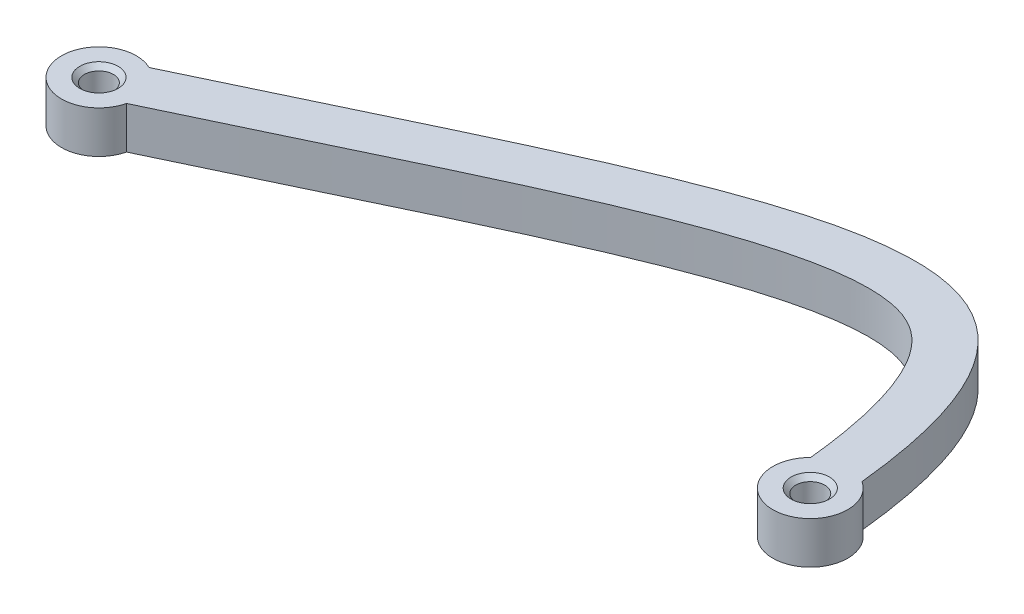
ISO-10303-21;
HEADER;
FILE_DESCRIPTION(('STEP AP214'),'2;1');
FILE_NAME('part.step','',(''),(''),'','','');
FILE_SCHEMA(('AUTOMOTIVE_DESIGN { 1 0 10303 214 1 1 1 1 }'));
ENDSEC;
DATA;
#1=APPLICATION_CONTEXT('core data for automotive mechanical design processes');
#2=APPLICATION_PROTOCOL_DEFINITION('international standard','automotive_design',2000,#1);
#3=PRODUCT_CONTEXT('',#1,'mechanical');
#4=PRODUCT('Part','Part','',(#3));
#5=PRODUCT_RELATED_PRODUCT_CATEGORY('part','',(#4));
#6=PRODUCT_DEFINITION_FORMATION('','',#4);
#7=PRODUCT_DEFINITION_CONTEXT('part definition',#1,'design');
#8=PRODUCT_DEFINITION('design','',#6,#7);
#9=PRODUCT_DEFINITION_SHAPE('','',#8);
#10=(LENGTH_UNIT() NAMED_UNIT(*) SI_UNIT(.MILLI.,.METRE.));
#11=(NAMED_UNIT(*) PLANE_ANGLE_UNIT() SI_UNIT($,.RADIAN.));
#12=(NAMED_UNIT(*) SI_UNIT($,.STERADIAN.) SOLID_ANGLE_UNIT());
#13=UNCERTAINTY_MEASURE_WITH_UNIT(LENGTH_MEASURE(1.E-05),#10,'distance_accuracy_value','');
#14=(GEOMETRIC_REPRESENTATION_CONTEXT(3) GLOBAL_UNCERTAINTY_ASSIGNED_CONTEXT((#13)) GLOBAL_UNIT_ASSIGNED_CONTEXT((#10,
#11,#12)) REPRESENTATION_CONTEXT('',''));
#15=CARTESIAN_POINT('',(0.,0.,0.));
#16=DIRECTION('',(0.,0.,1.));
#17=DIRECTION('',(1.,0.,0.));
#18=AXIS2_PLACEMENT_3D('',#15,#16,#17);
#19=CARTESIAN_POINT('',(-20.0068220679126,2.25,-26.221522701704));
#20=DIRECTION('',(0.,-1.,0.));
#21=DIRECTION('',(0.,0.,-1.));
#22=AXIS2_PLACEMENT_3D('',#19,#20,#21);
#23=PLANE('',#22);
#24=CARTESIAN_POINT('',(0.,2.25,0.));
#25=DIRECTION('',(0.,-1.,0.));
#26=DIRECTION('',(0.,0.,-1.));
#27=AXIS2_PLACEMENT_3D('',#24,#25,#26);
#28=CIRCLE('',#27,2.05);
#29=CARTESIAN_POINT('',(0.,2.25,-2.05));
#30=VERTEX_POINT('',#29);
#31=EDGE_CURVE('E163',#30,#30,#28,.T.);
#32=ORIENTED_EDGE('',*,*,#31,.T.);
#33=EDGE_LOOP('',(#32));
#34=FACE_BOUND('',#33,.T.);
#35=CARTESIAN_POINT('',(-76.,2.25,0.));
#36=DIRECTION('',(0.,-1.,0.));
#37=DIRECTION('',(0.,0.,-1.));
#38=AXIS2_PLACEMENT_3D('',#35,#36,#37);
#39=CIRCLE('',#38,2.05);
#40=CARTESIAN_POINT('',(-76.,2.25,-2.05));
#41=VERTEX_POINT('',#40);
#42=EDGE_CURVE('E160',#41,#41,#39,.T.);
#43=ORIENTED_EDGE('',*,*,#42,.T.);
#44=EDGE_LOOP('',(#43));
#45=FACE_BOUND('',#44,.T.);
#46=CARTESIAN_POINT('',(2.16521034825604,2.25,-3.36331148539713));
#47=CARTESIAN_POINT('',(-1.84275597609123,2.25,-42.0826184661503));
#48=CARTESIAN_POINT('',(-27.4854822715598,2.25,-25.5238141255043));
#49=CARTESIAN_POINT('',(-74.2350721486037,2.25,-3.58957235327075));
#50=B_SPLINE_CURVE_WITH_KNOTS('',3,(#46,#47,#48,#49),.UNSPECIFIED.,.F.,.F.,(4,4),(0.,1.),.UNSPECIFIED.);
#51=CARTESIAN_POINT('',(2.16521034825601,2.25,-3.3633114853972));
#52=VERTEX_POINT('',#51);
#53=CARTESIAN_POINT('',(-74.2350721486037,2.25,-3.58957235327075));
#54=VERTEX_POINT('',#53);
#55=EDGE_CURVE('E96',#52,#54,#50,.T.);
#56=ORIENTED_EDGE('',*,*,#55,.T.);
#57=CARTESIAN_POINT('',(-76.,2.25,0.));
#58=DIRECTION('',(0.,1.,0.));
#59=DIRECTION('',(0.,0.,1.));
#60=AXIS2_PLACEMENT_3D('',#57,#58,#59);
#61=CIRCLE('',#60,3.99999999999999);
#62=CARTESIAN_POINT('',(-72.1112857573067,2.25,0.93696400073567));
#63=VERTEX_POINT('',#62);
#64=EDGE_CURVE('E92',#54,#63,#61,.T.);
#65=ORIENTED_EDGE('',*,*,#64,.T.);
#66=CARTESIAN_POINT('',(-72.1112857573067,2.25,0.93696400073567));
#67=CARTESIAN_POINT('',(-71.3821086587353,2.25,0.594844490876723));
#68=CARTESIAN_POINT('',(-69.9172518529611,2.25,-0.0946674812417947));
#69=CARTESIAN_POINT('',(-67.0492347026385,2.25,-1.45209838040181));
#70=CARTESIAN_POINT('',(-63.5397248164269,2.25,-3.124374093198));
#71=CARTESIAN_POINT('',(-59.4624350414654,2.25,-5.07647076540553));
#72=CARTESIAN_POINT('',(-54.2014498106175,2.25,-7.59587191020724));
#73=CARTESIAN_POINT('',(-47.9583884669435,2.25,-10.5639693034175));
#74=CARTESIAN_POINT('',(-41.0092478115327,2.25,-13.7599567243929));
#75=CARTESIAN_POINT('',(-34.6176135266217,2.25,-16.513148973845));
#76=CARTESIAN_POINT('',(-26.8714634587332,2.25,-19.4961908332823));
#77=CARTESIAN_POINT('',(-20.3514077515302,2.25,-21.2887617021902));
#78=CARTESIAN_POINT('',(-15.3169779293599,2.25,-21.7237061739062));
#79=CARTESIAN_POINT('',(-12.356142276353,2.25,-21.425163203303));
#80=CARTESIAN_POINT('',(-10.1447843641901,2.25,-20.6311878605884));
#81=CARTESIAN_POINT('',(-8.3382104678954,2.25,-19.350526303668));
#82=CARTESIAN_POINT('',(-6.61139497063432,2.25,-17.2312488146454));
#83=CARTESIAN_POINT('',(-5.26785208659513,2.25,-14.4528619211077));
#84=CARTESIAN_POINT('',(-4.33267149351827,2.25,-11.5464314926159));
#85=CARTESIAN_POINT('',(-3.71702641805876,2.25,-9.0214731639908));
#86=CARTESIAN_POINT('',(-3.28527079561516,2.25,-6.61774498772705));
#87=CARTESIAN_POINT('',(-2.99498095393744,2.25,-4.53139498941589));
#88=CARTESIAN_POINT('',(-2.86561789125857,2.25,-3.40303645131264));
#89=CARTESIAN_POINT('',(-2.80821546980275,2.25,-2.84849537039467));
#90=B_SPLINE_CURVE_WITH_KNOTS('',3,(#66,#67,#68,#69,#70,#71,#72,#73,#74,#75,#76,#77,#78,#79,#80,
#81,#82,#83,#84,#85,#86,#87,#88,#89),.UNSPECIFIED.,.F.,.F.,(4,1,1,1,1,1,1,1,1,1,1,1,1,1,1,1,1,1,
1,1,1,4),(0.,0.015625,0.03125,0.0625,0.09375,0.125,0.1875,0.25,0.3125,0.375,0.5,0.5625,0.625,
0.6875,0.75,0.8125,0.875,0.90625,0.9375,0.96875,0.984375,1.),.UNSPECIFIED.);
#91=CARTESIAN_POINT('',(-2.80821546980275,2.25,-2.84849537039467));
#92=VERTEX_POINT('',#91);
#93=EDGE_CURVE('E94',#63,#92,#90,.T.);
#94=ORIENTED_EDGE('',*,*,#93,.T.);
#95=CARTESIAN_POINT('',(0.,2.25,0.));
#96=DIRECTION('',(0.,1.,0.));
#97=DIRECTION('',(0.,0.,1.));
#98=AXIS2_PLACEMENT_3D('',#95,#96,#97);
#99=CIRCLE('',#98,3.99999999999996);
#100=EDGE_CURVE('E61',#92,#52,#99,.T.);
#101=ORIENTED_EDGE('',*,*,#100,.T.);
#102=EDGE_LOOP('',(#56,#65,#94,#101));
#103=FACE_BOUND('',#102,.T.);
#104=ADVANCED_FACE('F43',(#34,#45,#103),#23,.F.);
#105=CARTESIAN_POINT('',(-20.0068220679126,-2.25,-26.221522701704));
#106=DIRECTION('',(0.,-1.,0.));
#107=DIRECTION('',(0.,0.,-1.));
#108=AXIS2_PLACEMENT_3D('',#105,#106,#107);
#109=PLANE('',#108);
#110=CARTESIAN_POINT('',(0.,-2.25,0.));
#111=DIRECTION('',(0.,-1.,0.));
#112=DIRECTION('',(0.,0.,-1.));
#113=AXIS2_PLACEMENT_3D('',#110,#111,#112);
#114=CIRCLE('',#113,2.05000000000001);
#115=CARTESIAN_POINT('',(0.,-2.25,-2.05000000000001));
#116=VERTEX_POINT('',#115);
#117=EDGE_CURVE('E151',#116,#116,#114,.F.);
#118=ORIENTED_EDGE('',*,*,#117,.T.);
#119=EDGE_LOOP('',(#118));
#120=FACE_BOUND('',#119,.T.);
#121=CARTESIAN_POINT('',(-76.,-2.25,0.));
#122=DIRECTION('',(0.,-1.,0.));
#123=DIRECTION('',(0.,0.,-1.));
#124=AXIS2_PLACEMENT_3D('',#121,#122,#123);
#125=CIRCLE('',#124,2.05000000000001);
#126=CARTESIAN_POINT('',(-76.,-2.25,-2.05000000000001));
#127=VERTEX_POINT('',#126);
#128=EDGE_CURVE('E148',#127,#127,#125,.F.);
#129=ORIENTED_EDGE('',*,*,#128,.T.);
#130=EDGE_LOOP('',(#129));
#131=FACE_BOUND('',#130,.T.);
#132=CARTESIAN_POINT('',(2.16521034825604,-2.25,-3.36331148539713));
#133=CARTESIAN_POINT('',(-1.84275597609123,-2.25,-42.0826184661503));
#134=CARTESIAN_POINT('',(-27.4854822715598,-2.25,-25.5238141255043));
#135=CARTESIAN_POINT('',(-74.2350721486037,-2.25,-3.58957235327075));
#136=B_SPLINE_CURVE_WITH_KNOTS('',3,(#132,#133,#134,#135),.UNSPECIFIED.,.F.,.F.,(4,4),(0.,1.),.UNSPECIFIED.);
#137=CARTESIAN_POINT('',(2.16521034825601,-2.25,-3.3633114853972));
#138=VERTEX_POINT('',#137);
#139=CARTESIAN_POINT('',(-74.2350721486037,-2.25,-3.58957235327075));
#140=VERTEX_POINT('',#139);
#141=EDGE_CURVE('E289',#138,#140,#136,.T.);
#142=ORIENTED_EDGE('',*,*,#141,.F.);
#143=CARTESIAN_POINT('',(0.,-2.25,0.));
#144=DIRECTION('',(0.,1.,0.));
#145=DIRECTION('',(0.,0.,1.));
#146=AXIS2_PLACEMENT_3D('',#143,#144,#145);
#147=CIRCLE('',#146,3.99999999999996);
#148=CARTESIAN_POINT('',(-2.80821546980275,-2.25,-2.84849537039467));
#149=VERTEX_POINT('',#148);
#150=EDGE_CURVE('E84',#149,#138,#147,.T.);
#151=ORIENTED_EDGE('',*,*,#150,.F.);
#152=CARTESIAN_POINT('',(-72.1112857573067,-2.25,0.93696400073567));
#153=CARTESIAN_POINT('',(-71.3821086587353,-2.25,0.594844490876723));
#154=CARTESIAN_POINT('',(-69.9172518529611,-2.25,-0.0946674812417947));
#155=CARTESIAN_POINT('',(-67.0492347026385,-2.25,-1.45209838040181));
#156=CARTESIAN_POINT('',(-63.5397248164269,-2.25,-3.124374093198));
#157=CARTESIAN_POINT('',(-59.4624350414654,-2.25,-5.07647076540553));
#158=CARTESIAN_POINT('',(-54.2014498106175,-2.25,-7.59587191020724));
#159=CARTESIAN_POINT('',(-47.9583884669435,-2.25,-10.5639693034175));
#160=CARTESIAN_POINT('',(-41.0092478115327,-2.25,-13.7599567243929));
#161=CARTESIAN_POINT('',(-34.6176135266217,-2.25,-16.513148973845));
#162=CARTESIAN_POINT('',(-26.8714634587332,-2.25,-19.4961908332823));
#163=CARTESIAN_POINT('',(-20.3514077515302,-2.25,-21.2887617021902));
#164=CARTESIAN_POINT('',(-15.3169779293599,-2.25,-21.7237061739062));
#165=CARTESIAN_POINT('',(-12.356142276353,-2.25,-21.425163203303));
#166=CARTESIAN_POINT('',(-10.1447843641901,-2.25,-20.6311878605884));
#167=CARTESIAN_POINT('',(-8.3382104678954,-2.25,-19.350526303668));
#168=CARTESIAN_POINT('',(-6.61139497063432,-2.25,-17.2312488146454));
#169=CARTESIAN_POINT('',(-5.26785208659513,-2.25,-14.4528619211077));
#170=CARTESIAN_POINT('',(-4.33267149351827,-2.25,-11.5464314926159));
#171=CARTESIAN_POINT('',(-3.71702641805876,-2.25,-9.0214731639908));
#172=CARTESIAN_POINT('',(-3.28527079561516,-2.25,-6.61774498772705));
#173=CARTESIAN_POINT('',(-2.99498095393744,-2.25,-4.53139498941589));
#174=CARTESIAN_POINT('',(-2.86561789125857,-2.25,-3.40303645131264));
#175=CARTESIAN_POINT('',(-2.80821546980275,-2.25,-2.84849537039467));
#176=B_SPLINE_CURVE_WITH_KNOTS('',3,(#152,#153,#154,#155,#156,#157,#158,#159,#160,#161,#162,
#163,#164,#165,#166,#167,#168,#169,#170,#171,#172,#173,#174,#175),.UNSPECIFIED.,.F.,.F.,(4,1,1,
1,1,1,1,1,1,1,1,1,1,1,1,1,1,1,1,1,1,4),(0.,0.015625,0.03125,0.0625,0.09375,0.125,0.1875,0.25,
0.3125,0.375,0.5,0.5625,0.625,0.6875,0.75,0.8125,0.875,0.90625,0.9375,0.96875,0.984375,1.),.UNSPECIFIED.);
#177=CARTESIAN_POINT('',(-72.1112857573067,-2.25,0.93696400073567));
#178=VERTEX_POINT('',#177);
#179=EDGE_CURVE('E78',#178,#149,#176,.T.);
#180=ORIENTED_EDGE('',*,*,#179,.F.);
#181=CARTESIAN_POINT('',(-76.,-2.25,0.));
#182=DIRECTION('',(0.,1.,0.));
#183=DIRECTION('',(0.,0.,1.));
#184=AXIS2_PLACEMENT_3D('',#181,#182,#183);
#185=CIRCLE('',#184,3.99999999999999);
#186=EDGE_CURVE('E101',#140,#178,#185,.T.);
#187=ORIENTED_EDGE('',*,*,#186,.F.);
#188=EDGE_LOOP('',(#142,#151,#180,#187));
#189=FACE_BOUND('',#188,.T.);
#190=ADVANCED_FACE('F128',(#120,#131,#189),#109,.T.);
#191=DIRECTION('',(0.,-1.,0.));
#192=VECTOR('',#191,1.);
#193=SURFACE_OF_LINEAR_EXTRUSION('',#50,#192);
#194=ORIENTED_EDGE('',*,*,#141,.T.);
#195=DIRECTION('',(0.,-1.,0.));
#196=VECTOR('',#195,1.);
#197=CARTESIAN_POINT('',(-74.2350721486037,2.25,-3.58957235327075));
#198=LINE('',#197,#196);
#199=EDGE_CURVE('E102',#54,#140,#198,.T.);
#200=ORIENTED_EDGE('',*,*,#199,.F.);
#201=ORIENTED_EDGE('',*,*,#55,.F.);
#202=DIRECTION('',(0.,-1.,0.));
#203=VECTOR('',#202,1.);
#204=CARTESIAN_POINT('',(2.16521034825601,2.25,-3.3633114853972));
#205=LINE('',#204,#203);
#206=EDGE_CURVE('E107',#52,#138,#205,.T.);
#207=ORIENTED_EDGE('',*,*,#206,.T.);
#208=EDGE_LOOP('',(#194,#200,#201,#207));
#209=FACE_BOUND('',#208,.T.);
#210=ADVANCED_FACE('F125',(#209),#193,.F.);
#211=CARTESIAN_POINT('',(-76.,2.25,0.));
#212=DIRECTION('',(0.,-1.,0.));
#213=DIRECTION('',(0.,0.,-1.));
#214=AXIS2_PLACEMENT_3D('',#211,#212,#213);
#215=CYLINDRICAL_SURFACE('',#214,3.99999999999999);
#216=ORIENTED_EDGE('',*,*,#186,.T.);
#217=DIRECTION('',(0.,-1.,0.));
#218=VECTOR('',#217,1.);
#219=CARTESIAN_POINT('',(-72.1112857573067,2.25,0.93696400073567));
#220=LINE('',#219,#218);
#221=EDGE_CURVE('E99',#63,#178,#220,.T.);
#222=ORIENTED_EDGE('',*,*,#221,.F.);
#223=ORIENTED_EDGE('',*,*,#64,.F.);
#224=ORIENTED_EDGE('',*,*,#199,.T.);
#225=EDGE_LOOP('',(#216,#222,#223,#224));
#226=FACE_BOUND('',#225,.T.);
#227=ADVANCED_FACE('F100',(#226),#215,.T.);
#228=DIRECTION('',(0.,-1.,0.));
#229=VECTOR('',#228,1.);
#230=SURFACE_OF_LINEAR_EXTRUSION('',#90,#229);
#231=ORIENTED_EDGE('',*,*,#179,.T.);
#232=DIRECTION('',(0.,-1.,0.));
#233=VECTOR('',#232,1.);
#234=CARTESIAN_POINT('',(-2.80821546980275,2.25,-2.84849537039467));
#235=LINE('',#234,#233);
#236=EDGE_CURVE('E103',#92,#149,#235,.T.);
#237=ORIENTED_EDGE('',*,*,#236,.F.);
#238=ORIENTED_EDGE('',*,*,#93,.F.);
#239=ORIENTED_EDGE('',*,*,#221,.T.);
#240=EDGE_LOOP('',(#231,#237,#238,#239));
#241=FACE_BOUND('',#240,.T.);
#242=ADVANCED_FACE('F105',(#241),#230,.F.);
#243=CARTESIAN_POINT('',(0.,2.25,0.));
#244=DIRECTION('',(0.,-1.,0.));
#245=DIRECTION('',(0.,0.,-1.));
#246=AXIS2_PLACEMENT_3D('',#243,#244,#245);
#247=CYLINDRICAL_SURFACE('',#246,3.99999999999996);
#248=ORIENTED_EDGE('',*,*,#150,.T.);
#249=ORIENTED_EDGE('',*,*,#206,.F.);
#250=ORIENTED_EDGE('',*,*,#100,.F.);
#251=ORIENTED_EDGE('',*,*,#236,.T.);
#252=EDGE_LOOP('',(#248,#249,#250,#251));
#253=FACE_BOUND('',#252,.T.);
#254=ADVANCED_FACE('F121',(#253),#247,.T.);
#255=CARTESIAN_POINT('',(-76.,2.25,0.));
#256=DIRECTION('',(0.,-1.,0.));
#257=DIRECTION('',(0.,0.,-1.));
#258=AXIS2_PLACEMENT_3D('',#255,#256,#257);
#259=CYLINDRICAL_SURFACE('',#258,1.54999999999999);
#260=CARTESIAN_POINT('',(-76.,-1.74999999999998,0.));
#261=DIRECTION('',(0.,-1.,0.));
#262=DIRECTION('',(0.,0.,-1.));
#263=AXIS2_PLACEMENT_3D('',#260,#261,#262);
#264=CIRCLE('',#263,1.54999999999999);
#265=CARTESIAN_POINT('',(-76.,-1.74999999999998,-1.54999999999999));
#266=VERTEX_POINT('',#265);
#267=EDGE_CURVE('E11',#266,#266,#264,.T.);
#268=ORIENTED_EDGE('',*,*,#267,.T.);
#269=EDGE_LOOP('',(#268));
#270=FACE_BOUND('',#269,.T.);
#271=CARTESIAN_POINT('',(-76.,1.74999999999999,0.));
#272=DIRECTION('',(0.,-1.,0.));
#273=DIRECTION('',(0.,0.,-1.));
#274=AXIS2_PLACEMENT_3D('',#271,#272,#273);
#275=CIRCLE('',#274,1.54999999999999);
#276=CARTESIAN_POINT('',(-76.,1.74999999999999,-1.54999999999999));
#277=VERTEX_POINT('',#276);
#278=EDGE_CURVE('E53',#277,#277,#275,.F.);
#279=ORIENTED_EDGE('',*,*,#278,.T.);
#280=EDGE_LOOP('',(#279));
#281=FACE_BOUND('',#280,.T.);
#282=ADVANCED_FACE('F168',(#270,#281),#259,.F.);
#283=CARTESIAN_POINT('',(0.,2.25,0.));
#284=DIRECTION('',(0.,-1.,0.));
#285=DIRECTION('',(0.,0.,-1.));
#286=AXIS2_PLACEMENT_3D('',#283,#284,#285);
#287=CYLINDRICAL_SURFACE('',#286,1.54999999999999);
#288=CARTESIAN_POINT('',(0.,-1.74999999999998,0.));
#289=DIRECTION('',(0.,-1.,0.));
#290=DIRECTION('',(0.,0.,-1.));
#291=AXIS2_PLACEMENT_3D('',#288,#289,#290);
#292=CIRCLE('',#291,1.54999999999999);
#293=CARTESIAN_POINT('',(0.,-1.74999999999998,-1.54999999999999));
#294=VERTEX_POINT('',#293);
#295=EDGE_CURVE('E157',#294,#294,#292,.T.);
#296=ORIENTED_EDGE('',*,*,#295,.T.);
#297=EDGE_LOOP('',(#296));
#298=FACE_BOUND('',#297,.T.);
#299=CARTESIAN_POINT('',(0.,1.74999999999999,0.));
#300=DIRECTION('',(0.,-1.,0.));
#301=DIRECTION('',(0.,0.,-1.));
#302=AXIS2_PLACEMENT_3D('',#299,#300,#301);
#303=CIRCLE('',#302,1.54999999999999);
#304=CARTESIAN_POINT('',(0.,1.74999999999999,-1.54999999999999));
#305=VERTEX_POINT('',#304);
#306=EDGE_CURVE('E154',#305,#305,#303,.F.);
#307=ORIENTED_EDGE('',*,*,#306,.T.);
#308=EDGE_LOOP('',(#307));
#309=FACE_BOUND('',#308,.T.);
#310=ADVANCED_FACE('F191',(#298,#309),#287,.F.);
#311=CARTESIAN_POINT('',(0.,-2.25,0.));
#312=DIRECTION('',(0.,-1.,0.));
#313=DIRECTION('',(0.,0.,-1.));
#314=AXIS2_PLACEMENT_3D('',#311,#312,#313);
#315=CONICAL_SURFACE('',#314,2.05000000000001,0.785398163397447);
#316=ORIENTED_EDGE('',*,*,#295,.F.);
#317=EDGE_LOOP('',(#316));
#318=FACE_BOUND('',#317,.T.);
#319=ORIENTED_EDGE('',*,*,#117,.F.);
#320=EDGE_LOOP('',(#319));
#321=FACE_BOUND('',#320,.T.);
#322=ADVANCED_FACE('F131',(#318,#321),#315,.F.);
#323=CARTESIAN_POINT('',(0.,1.74999999999999,0.));
#324=DIRECTION('',(0.,1.,0.));
#325=DIRECTION('',(0.,0.,1.));
#326=AXIS2_PLACEMENT_3D('',#323,#324,#325);
#327=CONICAL_SURFACE('',#326,1.54999999999999,0.785398163397443);
#328=ORIENTED_EDGE('',*,*,#31,.F.);
#329=EDGE_LOOP('',(#328));
#330=FACE_BOUND('',#329,.T.);
#331=ORIENTED_EDGE('',*,*,#306,.F.);
#332=EDGE_LOOP('',(#331));
#333=FACE_BOUND('',#332,.T.);
#334=ADVANCED_FACE('F176',(#330,#333),#327,.F.);
#335=CARTESIAN_POINT('',(-76.,-2.25,0.));
#336=DIRECTION('',(0.,-1.,0.));
#337=DIRECTION('',(0.,0.,-1.));
#338=AXIS2_PLACEMENT_3D('',#335,#336,#337);
#339=CONICAL_SURFACE('',#338,2.05000000000001,0.785398163397447);
#340=ORIENTED_EDGE('',*,*,#267,.F.);
#341=EDGE_LOOP('',(#340));
#342=FACE_BOUND('',#341,.T.);
#343=ORIENTED_EDGE('',*,*,#128,.F.);
#344=EDGE_LOOP('',(#343));
#345=FACE_BOUND('',#344,.T.);
#346=ADVANCED_FACE('F171',(#342,#345),#339,.F.);
#347=CARTESIAN_POINT('',(-76.,1.74999999999999,0.));
#348=DIRECTION('',(0.,1.,0.));
#349=DIRECTION('',(0.,0.,1.));
#350=AXIS2_PLACEMENT_3D('',#347,#348,#349);
#351=CONICAL_SURFACE('',#350,1.54999999999999,0.785398163397443);
#352=ORIENTED_EDGE('',*,*,#42,.F.);
#353=EDGE_LOOP('',(#352));
#354=FACE_BOUND('',#353,.T.);
#355=ORIENTED_EDGE('',*,*,#278,.F.);
#356=EDGE_LOOP('',(#355));
#357=FACE_BOUND('',#356,.T.);
#358=ADVANCED_FACE('F46',(#354,#357),#351,.F.);
#359=CLOSED_SHELL('',(#104,#190,#210,#227,#242,#254,#282,#310,#322,#334,#346,#358));
#360=MANIFOLD_SOLID_BREP('B2',#359);
#361=ADVANCED_BREP_SHAPE_REPRESENTATION('',(#18,#360),#14);
#362=SHAPE_DEFINITION_REPRESENTATION(#9,#361);
ENDSEC;
END-ISO-10303-21;
